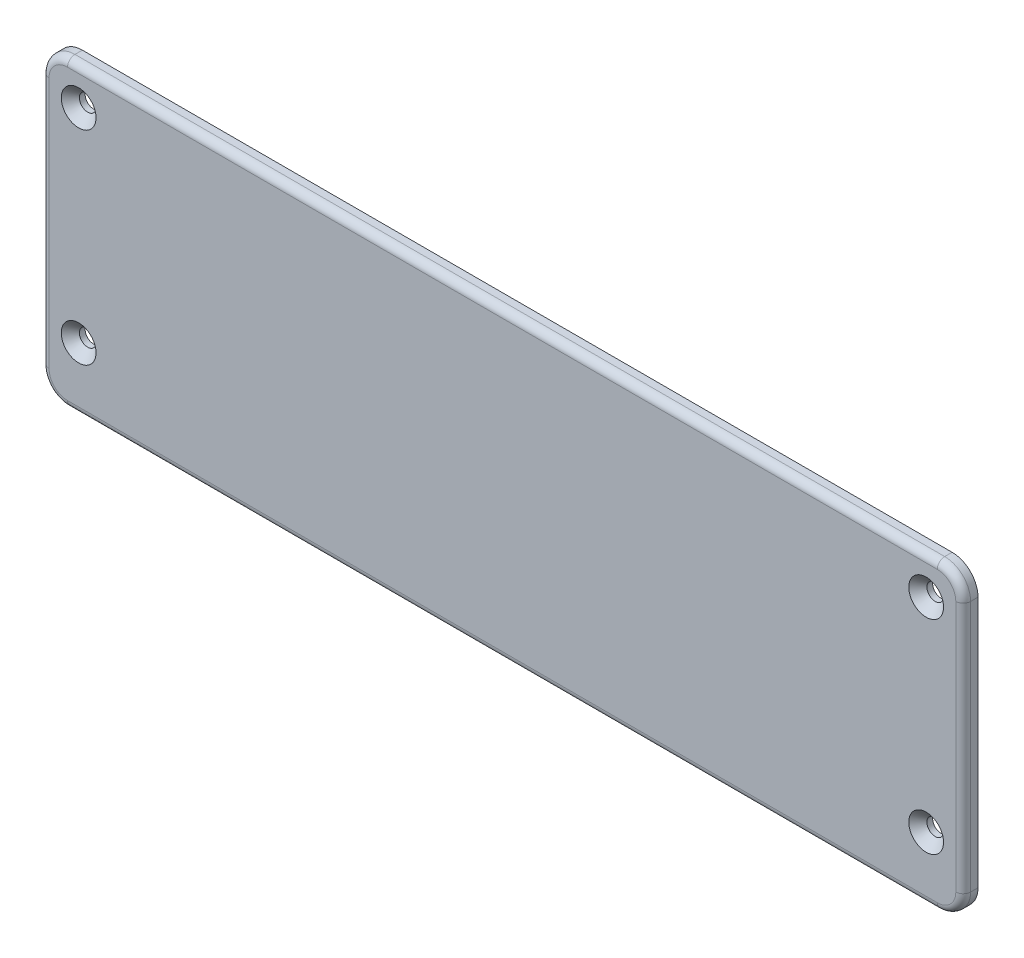
ISO-10303-21;
HEADER;
FILE_DESCRIPTION(('STEP AP214'),'2;1');
FILE_NAME('part.step','',(''),(''),'','','');
FILE_SCHEMA(('AUTOMOTIVE_DESIGN { 1 0 10303 214 1 1 1 1 }'));
ENDSEC;
DATA;
#1=APPLICATION_CONTEXT('core data for automotive mechanical design processes');
#2=APPLICATION_PROTOCOL_DEFINITION('international standard','automotive_design',2000,#1);
#3=PRODUCT_CONTEXT('',#1,'mechanical');
#4=PRODUCT('Part','Part','',(#3));
#5=PRODUCT_RELATED_PRODUCT_CATEGORY('part','',(#4));
#6=PRODUCT_DEFINITION_FORMATION('','',#4);
#7=PRODUCT_DEFINITION_CONTEXT('part definition',#1,'design');
#8=PRODUCT_DEFINITION('design','',#6,#7);
#9=PRODUCT_DEFINITION_SHAPE('','',#8);
#10=(LENGTH_UNIT() NAMED_UNIT(*) SI_UNIT(.MILLI.,.METRE.));
#11=(NAMED_UNIT(*) PLANE_ANGLE_UNIT() SI_UNIT($,.RADIAN.));
#12=(NAMED_UNIT(*) SI_UNIT($,.STERADIAN.) SOLID_ANGLE_UNIT());
#13=UNCERTAINTY_MEASURE_WITH_UNIT(LENGTH_MEASURE(1.E-05),#10,'distance_accuracy_value','');
#14=(GEOMETRIC_REPRESENTATION_CONTEXT(3) GLOBAL_UNCERTAINTY_ASSIGNED_CONTEXT((#13)) GLOBAL_UNIT_ASSIGNED_CONTEXT((#10,
#11,#12)) REPRESENTATION_CONTEXT('',''));
#15=CARTESIAN_POINT('',(0.,0.,0.));
#16=DIRECTION('',(0.,0.,1.));
#17=DIRECTION('',(1.,0.,0.));
#18=AXIS2_PLACEMENT_3D('',#15,#16,#17);
#19=CARTESIAN_POINT('',(-124.5,41.,4.));
#20=DIRECTION('',(0.,-1.,0.));
#21=DIRECTION('',(0.,0.,-1.));
#22=AXIS2_PLACEMENT_3D('',#19,#20,#21);
#23=PLANE('',#22);
#24=DIRECTION('',(0.,0.,-1.));
#25=VECTOR('',#24,1.);
#26=CARTESIAN_POINT('',(-117.5,41.,4.));
#27=LINE('',#26,#25);
#28=CARTESIAN_POINT('',(-117.5,41.,0.));
#29=VERTEX_POINT('',#28);
#30=CARTESIAN_POINT('',(-117.5,41.,2.));
#31=VERTEX_POINT('',#30);
#32=EDGE_CURVE('E143',#29,#31,#27,.F.);
#33=ORIENTED_EDGE('',*,*,#32,.T.);
#34=DIRECTION('',(-1.,0.,0.));
#35=VECTOR('',#34,1.);
#36=CARTESIAN_POINT('',(-124.5,41.,2.));
#37=LINE('',#36,#35);
#38=CARTESIAN_POINT('',(117.5,41.,2.));
#39=VERTEX_POINT('',#38);
#40=EDGE_CURVE('E139',#31,#39,#37,.F.);
#41=ORIENTED_EDGE('',*,*,#40,.T.);
#42=DIRECTION('',(0.,0.,-1.));
#43=VECTOR('',#42,1.);
#44=CARTESIAN_POINT('',(117.5,41.,4.));
#45=LINE('',#44,#43);
#46=CARTESIAN_POINT('',(117.5,41.,0.));
#47=VERTEX_POINT('',#46);
#48=EDGE_CURVE('E132',#39,#47,#45,.T.);
#49=ORIENTED_EDGE('',*,*,#48,.T.);
#50=DIRECTION('',(-1.,0.,0.));
#51=VECTOR('',#50,1.);
#52=CARTESIAN_POINT('',(-124.5,41.,0.));
#53=LINE('',#52,#51);
#54=EDGE_CURVE('E136',#47,#29,#53,.T.);
#55=ORIENTED_EDGE('',*,*,#54,.T.);
#56=EDGE_LOOP('',(#33,#41,#49,#55));
#57=FACE_BOUND('',#56,.T.);
#58=ADVANCED_FACE('F41',(#57),#23,.F.);
#59=CARTESIAN_POINT('',(-124.5,41.,4.));
#60=DIRECTION('',(1.,0.,0.));
#61=DIRECTION('',(0.,0.,-1.));
#62=AXIS2_PLACEMENT_3D('',#59,#60,#61);
#63=PLANE('',#62);
#64=DIRECTION('',(0.,0.,-1.));
#65=VECTOR('',#64,1.);
#66=CARTESIAN_POINT('',(-124.5,-34.,4.));
#67=LINE('',#66,#65);
#68=CARTESIAN_POINT('',(-124.5,-34.,0.));
#69=VERTEX_POINT('',#68);
#70=CARTESIAN_POINT('',(-124.5,-34.,2.));
#71=VERTEX_POINT('',#70);
#72=EDGE_CURVE('E186',#69,#71,#67,.F.);
#73=ORIENTED_EDGE('',*,*,#72,.T.);
#74=DIRECTION('',(0.,-1.,0.));
#75=VECTOR('',#74,1.);
#76=CARTESIAN_POINT('',(-124.5,41.,2.));
#77=LINE('',#76,#75);
#78=CARTESIAN_POINT('',(-124.5,34.,2.));
#79=VERTEX_POINT('',#78);
#80=EDGE_CURVE('E209',#71,#79,#77,.F.);
#81=ORIENTED_EDGE('',*,*,#80,.T.);
#82=DIRECTION('',(0.,0.,-1.));
#83=VECTOR('',#82,1.);
#84=CARTESIAN_POINT('',(-124.5,34.,4.));
#85=LINE('',#84,#83);
#86=CARTESIAN_POINT('',(-124.5,34.,0.));
#87=VERTEX_POINT('',#86);
#88=EDGE_CURVE('E184',#79,#87,#85,.T.);
#89=ORIENTED_EDGE('',*,*,#88,.T.);
#90=DIRECTION('',(0.,-1.,0.));
#91=VECTOR('',#90,1.);
#92=CARTESIAN_POINT('',(-124.5,41.,0.));
#93=LINE('',#92,#91);
#94=EDGE_CURVE('E158',#87,#69,#93,.T.);
#95=ORIENTED_EDGE('',*,*,#94,.T.);
#96=EDGE_LOOP('',(#73,#81,#89,#95));
#97=FACE_BOUND('',#96,.T.);
#98=ADVANCED_FACE('F303',(#97),#63,.F.);
#99=CARTESIAN_POINT('',(-124.5,-41.,4.));
#100=DIRECTION('',(0.,1.,0.));
#101=DIRECTION('',(0.,0.,1.));
#102=AXIS2_PLACEMENT_3D('',#99,#100,#101);
#103=PLANE('',#102);
#104=DIRECTION('',(0.,0.,-1.));
#105=VECTOR('',#104,1.);
#106=CARTESIAN_POINT('',(117.5,-41.,4.));
#107=LINE('',#106,#105);
#108=CARTESIAN_POINT('',(117.5,-41.,0.));
#109=VERTEX_POINT('',#108);
#110=CARTESIAN_POINT('',(117.5,-41.,2.));
#111=VERTEX_POINT('',#110);
#112=EDGE_CURVE('E182',#109,#111,#107,.F.);
#113=ORIENTED_EDGE('',*,*,#112,.T.);
#114=DIRECTION('',(1.,0.,0.));
#115=VECTOR('',#114,1.);
#116=CARTESIAN_POINT('',(-124.5,-41.,2.));
#117=LINE('',#116,#115);
#118=CARTESIAN_POINT('',(-117.5,-41.,2.));
#119=VERTEX_POINT('',#118);
#120=EDGE_CURVE('E11',#111,#119,#117,.F.);
#121=ORIENTED_EDGE('',*,*,#120,.T.);
#122=DIRECTION('',(0.,0.,-1.));
#123=VECTOR('',#122,1.);
#124=CARTESIAN_POINT('',(-117.5,-41.,4.));
#125=LINE('',#124,#123);
#126=CARTESIAN_POINT('',(-117.5,-41.,0.));
#127=VERTEX_POINT('',#126);
#128=EDGE_CURVE('E180',#119,#127,#125,.T.);
#129=ORIENTED_EDGE('',*,*,#128,.T.);
#130=DIRECTION('',(1.,0.,0.));
#131=VECTOR('',#130,1.);
#132=CARTESIAN_POINT('',(-124.5,-41.,0.));
#133=LINE('',#132,#131);
#134=EDGE_CURVE('E162',#127,#109,#133,.T.);
#135=ORIENTED_EDGE('',*,*,#134,.T.);
#136=EDGE_LOOP('',(#113,#121,#129,#135));
#137=FACE_BOUND('',#136,.T.);
#138=ADVANCED_FACE('F298',(#137),#103,.F.);
#139=CARTESIAN_POINT('',(124.5,41.,4.));
#140=DIRECTION('',(-1.,0.,0.));
#141=DIRECTION('',(0.,0.,1.));
#142=AXIS2_PLACEMENT_3D('',#139,#140,#141);
#143=PLANE('',#142);
#144=DIRECTION('',(0.,0.,-1.));
#145=VECTOR('',#144,1.);
#146=CARTESIAN_POINT('',(124.5,34.,4.));
#147=LINE('',#146,#145);
#148=CARTESIAN_POINT('',(124.5,34.,0.));
#149=VERTEX_POINT('',#148);
#150=CARTESIAN_POINT('',(124.5,34.,2.));
#151=VERTEX_POINT('',#150);
#152=EDGE_CURVE('E148',#149,#151,#147,.F.);
#153=ORIENTED_EDGE('',*,*,#152,.T.);
#154=DIRECTION('',(0.,1.,0.));
#155=VECTOR('',#154,1.);
#156=CARTESIAN_POINT('',(124.5,41.,2.));
#157=LINE('',#156,#155);
#158=CARTESIAN_POINT('',(124.5,-34.,2.));
#159=VERTEX_POINT('',#158);
#160=EDGE_CURVE('E65',#151,#159,#157,.F.);
#161=ORIENTED_EDGE('',*,*,#160,.T.);
#162=DIRECTION('',(0.,0.,-1.));
#163=VECTOR('',#162,1.);
#164=CARTESIAN_POINT('',(124.5,-34.,4.));
#165=LINE('',#164,#163);
#166=CARTESIAN_POINT('',(124.5,-34.,0.));
#167=VERTEX_POINT('',#166);
#168=EDGE_CURVE('E152',#159,#167,#165,.T.);
#169=ORIENTED_EDGE('',*,*,#168,.T.);
#170=DIRECTION('',(0.,1.,0.));
#171=VECTOR('',#170,1.);
#172=CARTESIAN_POINT('',(124.5,41.,0.));
#173=LINE('',#172,#171);
#174=EDGE_CURVE('E171',#167,#149,#173,.T.);
#175=ORIENTED_EDGE('',*,*,#174,.T.);
#176=EDGE_LOOP('',(#153,#161,#169,#175));
#177=FACE_BOUND('',#176,.T.);
#178=ADVANCED_FACE('F288',(#177),#143,.F.);
#179=CARTESIAN_POINT('',(0.,0.,4.));
#180=DIRECTION('',(0.,0.,-1.));
#181=DIRECTION('',(-1.,0.,0.));
#182=AXIS2_PLACEMENT_3D('',#179,#180,#181);
#183=PLANE('',#182);
#184=DIRECTION('',(0.,-1.,0.));
#185=VECTOR('',#184,1.);
#186=CARTESIAN_POINT('',(-122.5,0.,4.));
#187=LINE('',#186,#185);
#188=CARTESIAN_POINT('',(-122.5,34.,4.));
#189=VERTEX_POINT('',#188);
#190=CARTESIAN_POINT('',(-122.5,-34.,4.));
#191=VERTEX_POINT('',#190);
#192=EDGE_CURVE('E201',#189,#191,#187,.T.);
#193=ORIENTED_EDGE('',*,*,#192,.T.);
#194=CARTESIAN_POINT('',(-117.5,-34.,4.));
#195=DIRECTION('',(0.,0.,-1.));
#196=DIRECTION('',(-1.,0.,0.));
#197=AXIS2_PLACEMENT_3D('',#194,#195,#196);
#198=CIRCLE('',#197,5.);
#199=CARTESIAN_POINT('',(-117.5,-39.,4.));
#200=VERTEX_POINT('',#199);
#201=EDGE_CURVE('E203',#191,#200,#198,.F.);
#202=ORIENTED_EDGE('',*,*,#201,.T.);
#203=DIRECTION('',(1.,0.,0.));
#204=VECTOR('',#203,1.);
#205=CARTESIAN_POINT('',(0.,-39.,4.));
#206=LINE('',#205,#204);
#207=CARTESIAN_POINT('',(117.5,-39.,4.));
#208=VERTEX_POINT('',#207);
#209=EDGE_CURVE('E189',#200,#208,#206,.T.);
#210=ORIENTED_EDGE('',*,*,#209,.T.);
#211=CARTESIAN_POINT('',(117.5,-34.,4.));
#212=DIRECTION('',(0.,0.,-1.));
#213=DIRECTION('',(-1.,0.,0.));
#214=AXIS2_PLACEMENT_3D('',#211,#212,#213);
#215=CIRCLE('',#214,5.);
#216=CARTESIAN_POINT('',(122.5,-34.,4.));
#217=VERTEX_POINT('',#216);
#218=EDGE_CURVE('E191',#208,#217,#215,.F.);
#219=ORIENTED_EDGE('',*,*,#218,.T.);
#220=DIRECTION('',(0.,1.,0.));
#221=VECTOR('',#220,1.);
#222=CARTESIAN_POINT('',(122.5,0.,4.));
#223=LINE('',#222,#221);
#224=CARTESIAN_POINT('',(122.5,34.,4.));
#225=VERTEX_POINT('',#224);
#226=EDGE_CURVE('E193',#217,#225,#223,.T.);
#227=ORIENTED_EDGE('',*,*,#226,.T.);
#228=CARTESIAN_POINT('',(117.5,34.,4.));
#229=DIRECTION('',(0.,0.,-1.));
#230=DIRECTION('',(-1.,0.,0.));
#231=AXIS2_PLACEMENT_3D('',#228,#229,#230);
#232=CIRCLE('',#231,5.);
#233=CARTESIAN_POINT('',(117.5,39.,4.));
#234=VERTEX_POINT('',#233);
#235=EDGE_CURVE('E195',#225,#234,#232,.F.);
#236=ORIENTED_EDGE('',*,*,#235,.T.);
#237=DIRECTION('',(-1.,0.,0.));
#238=VECTOR('',#237,1.);
#239=CARTESIAN_POINT('',(0.,39.,4.));
#240=LINE('',#239,#238);
#241=CARTESIAN_POINT('',(-117.5,39.,4.));
#242=VERTEX_POINT('',#241);
#243=EDGE_CURVE('E197',#234,#242,#240,.T.);
#244=ORIENTED_EDGE('',*,*,#243,.T.);
#245=CARTESIAN_POINT('',(-117.5,34.,4.));
#246=DIRECTION('',(0.,0.,-1.));
#247=DIRECTION('',(-1.,0.,0.));
#248=AXIS2_PLACEMENT_3D('',#245,#246,#247);
#249=CIRCLE('',#248,5.);
#250=EDGE_CURVE('E199',#242,#189,#249,.F.);
#251=ORIENTED_EDGE('',*,*,#250,.T.);
#252=EDGE_LOOP('',(#193,#202,#210,#219,#227,#236,#244,#251));
#253=FACE_BOUND('',#252,.T.);
#254=CARTESIAN_POINT('',(114.5,-24.,4.));
#255=DIRECTION('',(0.,0.,1.));
#256=DIRECTION('',(1.,0.,0.));
#257=AXIS2_PLACEMENT_3D('',#254,#255,#256);
#258=CIRCLE('',#257,4.7);
#259=CARTESIAN_POINT('',(119.2,-24.,4.));
#260=VERTEX_POINT('',#259);
#261=EDGE_CURVE('E239',#260,#260,#258,.T.);
#262=ORIENTED_EDGE('',*,*,#261,.F.);
#263=EDGE_LOOP('',(#262));
#264=FACE_BOUND('',#263,.T.);
#265=CARTESIAN_POINT('',(114.5,31.,4.));
#266=DIRECTION('',(0.,0.,1.));
#267=DIRECTION('',(1.,0.,0.));
#268=AXIS2_PLACEMENT_3D('',#265,#266,#267);
#269=CIRCLE('',#268,4.7);
#270=CARTESIAN_POINT('',(119.2,31.,4.));
#271=VERTEX_POINT('',#270);
#272=EDGE_CURVE('E254',#271,#271,#269,.T.);
#273=ORIENTED_EDGE('',*,*,#272,.F.);
#274=EDGE_LOOP('',(#273));
#275=FACE_BOUND('',#274,.T.);
#276=CARTESIAN_POINT('',(-114.5,31.,4.));
#277=DIRECTION('',(0.,0.,1.));
#278=DIRECTION('',(1.,0.,0.));
#279=AXIS2_PLACEMENT_3D('',#276,#277,#278);
#280=CIRCLE('',#279,4.7);
#281=CARTESIAN_POINT('',(-109.8,31.,4.));
#282=VERTEX_POINT('',#281);
#283=EDGE_CURVE('E263',#282,#282,#280,.T.);
#284=ORIENTED_EDGE('',*,*,#283,.F.);
#285=EDGE_LOOP('',(#284));
#286=FACE_BOUND('',#285,.T.);
#287=CARTESIAN_POINT('',(-114.5,-24.,4.));
#288=DIRECTION('',(0.,0.,1.));
#289=DIRECTION('',(1.,0.,0.));
#290=AXIS2_PLACEMENT_3D('',#287,#288,#289);
#291=CIRCLE('',#290,4.7);
#292=CARTESIAN_POINT('',(-109.8,-24.,4.));
#293=VERTEX_POINT('',#292);
#294=EDGE_CURVE('E272',#293,#293,#291,.T.);
#295=ORIENTED_EDGE('',*,*,#294,.F.);
#296=EDGE_LOOP('',(#295));
#297=FACE_BOUND('',#296,.T.);
#298=ADVANCED_FACE('F286',(#253,#264,#275,#286,#297),#183,.F.);
#299=CARTESIAN_POINT('',(0.,0.,0.));
#300=DIRECTION('',(0.,0.,-1.));
#301=DIRECTION('',(-1.,0.,0.));
#302=AXIS2_PLACEMENT_3D('',#299,#300,#301);
#303=PLANE('',#302);
#304=CARTESIAN_POINT('',(114.5,-24.,0.));
#305=DIRECTION('',(0.,0.,1.));
#306=DIRECTION('',(1.,0.,0.));
#307=AXIS2_PLACEMENT_3D('',#304,#305,#306);
#308=CIRCLE('',#307,2.25);
#309=CARTESIAN_POINT('',(116.75,-24.,0.));
#310=VERTEX_POINT('',#309);
#311=EDGE_CURVE('E249',#310,#310,#308,.T.);
#312=ORIENTED_EDGE('',*,*,#311,.T.);
#313=EDGE_LOOP('',(#312));
#314=FACE_BOUND('',#313,.T.);
#315=CARTESIAN_POINT('',(114.5,31.,0.));
#316=DIRECTION('',(0.,0.,1.));
#317=DIRECTION('',(1.,0.,0.));
#318=AXIS2_PLACEMENT_3D('',#315,#316,#317);
#319=CIRCLE('',#318,2.25);
#320=CARTESIAN_POINT('',(116.75,31.,0.));
#321=VERTEX_POINT('',#320);
#322=EDGE_CURVE('E260',#321,#321,#319,.T.);
#323=ORIENTED_EDGE('',*,*,#322,.T.);
#324=EDGE_LOOP('',(#323));
#325=FACE_BOUND('',#324,.T.);
#326=CARTESIAN_POINT('',(-114.5,31.,0.));
#327=DIRECTION('',(0.,0.,1.));
#328=DIRECTION('',(1.,0.,0.));
#329=AXIS2_PLACEMENT_3D('',#326,#327,#328);
#330=CIRCLE('',#329,2.25);
#331=CARTESIAN_POINT('',(-112.25,31.,0.));
#332=VERTEX_POINT('',#331);
#333=EDGE_CURVE('E269',#332,#332,#330,.T.);
#334=ORIENTED_EDGE('',*,*,#333,.T.);
#335=EDGE_LOOP('',(#334));
#336=FACE_BOUND('',#335,.T.);
#337=CARTESIAN_POINT('',(-114.5,-24.,0.));
#338=DIRECTION('',(0.,0.,1.));
#339=DIRECTION('',(1.,0.,0.));
#340=AXIS2_PLACEMENT_3D('',#337,#338,#339);
#341=CIRCLE('',#340,2.25);
#342=CARTESIAN_POINT('',(-112.25,-24.,0.));
#343=VERTEX_POINT('',#342);
#344=EDGE_CURVE('E159',#343,#343,#341,.T.);
#345=ORIENTED_EDGE('',*,*,#344,.T.);
#346=EDGE_LOOP('',(#345));
#347=FACE_BOUND('',#346,.T.);
#348=ORIENTED_EDGE('',*,*,#54,.F.);
#349=CARTESIAN_POINT('',(117.5,34.,0.));
#350=DIRECTION('',(0.,0.,-1.));
#351=DIRECTION('',(-1.,0.,0.));
#352=AXIS2_PLACEMENT_3D('',#349,#350,#351);
#353=CIRCLE('',#352,7.);
#354=EDGE_CURVE('E146',#47,#149,#353,.T.);
#355=ORIENTED_EDGE('',*,*,#354,.T.);
#356=ORIENTED_EDGE('',*,*,#174,.F.);
#357=CARTESIAN_POINT('',(117.5,-34.,0.));
#358=DIRECTION('',(0.,0.,-1.));
#359=DIRECTION('',(-1.,0.,0.));
#360=AXIS2_PLACEMENT_3D('',#357,#358,#359);
#361=CIRCLE('',#360,7.);
#362=EDGE_CURVE('E153',#167,#109,#361,.T.);
#363=ORIENTED_EDGE('',*,*,#362,.T.);
#364=ORIENTED_EDGE('',*,*,#134,.F.);
#365=CARTESIAN_POINT('',(-117.5,-34.,0.));
#366=DIRECTION('',(0.,0.,-1.));
#367=DIRECTION('',(-1.,0.,0.));
#368=AXIS2_PLACEMENT_3D('',#365,#366,#367);
#369=CIRCLE('',#368,7.);
#370=EDGE_CURVE('E175',#127,#69,#369,.T.);
#371=ORIENTED_EDGE('',*,*,#370,.T.);
#372=ORIENTED_EDGE('',*,*,#94,.F.);
#373=CARTESIAN_POINT('',(-117.5,34.,0.));
#374=DIRECTION('',(0.,0.,-1.));
#375=DIRECTION('',(-1.,0.,0.));
#376=AXIS2_PLACEMENT_3D('',#373,#374,#375);
#377=CIRCLE('',#376,7.);
#378=EDGE_CURVE('E142',#87,#29,#377,.T.);
#379=ORIENTED_EDGE('',*,*,#378,.T.);
#380=EDGE_LOOP('',(#348,#355,#356,#363,#364,#371,#372,#379));
#381=FACE_BOUND('',#380,.T.);
#382=ADVANCED_FACE('F155',(#314,#325,#336,#347,#381),#303,.T.);
#383=CARTESIAN_POINT('',(-114.5,-24.,4.));
#384=DIRECTION('',(0.,0.,1.));
#385=DIRECTION('',(1.,0.,0.));
#386=AXIS2_PLACEMENT_3D('',#383,#384,#385);
#387=CYLINDRICAL_SURFACE('',#386,2.25);
#388=ORIENTED_EDGE('',*,*,#344,.F.);
#389=EDGE_LOOP('',(#388));
#390=FACE_BOUND('',#389,.T.);
#391=CARTESIAN_POINT('',(-114.5,-24.,1.54999999999999));
#392=DIRECTION('',(0.,0.,1.));
#393=DIRECTION('',(1.,0.,0.));
#394=AXIS2_PLACEMENT_3D('',#391,#392,#393);
#395=CIRCLE('',#394,2.24999999999999);
#396=CARTESIAN_POINT('',(-112.25,-24.,1.54999999999999));
#397=VERTEX_POINT('',#396);
#398=EDGE_CURVE('E165',#397,#397,#395,.T.);
#399=ORIENTED_EDGE('',*,*,#398,.T.);
#400=EDGE_LOOP('',(#399));
#401=FACE_BOUND('',#400,.T.);
#402=ADVANCED_FACE('F277',(#390,#401),#387,.F.);
#403=CARTESIAN_POINT('',(-114.5,-24.,4.));
#404=DIRECTION('',(0.,0.,1.));
#405=DIRECTION('',(1.,0.,0.));
#406=AXIS2_PLACEMENT_3D('',#403,#404,#405);
#407=CONICAL_SURFACE('',#406,4.7,0.785398163397448);
#408=ORIENTED_EDGE('',*,*,#398,.F.);
#409=EDGE_LOOP('',(#408));
#410=FACE_BOUND('',#409,.T.);
#411=ORIENTED_EDGE('',*,*,#294,.T.);
#412=EDGE_LOOP('',(#411));
#413=FACE_BOUND('',#412,.T.);
#414=ADVANCED_FACE('F279',(#410,#413),#407,.F.);
#415=CARTESIAN_POINT('',(-114.5,31.,4.));
#416=DIRECTION('',(0.,0.,1.));
#417=DIRECTION('',(1.,0.,0.));
#418=AXIS2_PLACEMENT_3D('',#415,#416,#417);
#419=CYLINDRICAL_SURFACE('',#418,2.25);
#420=ORIENTED_EDGE('',*,*,#333,.F.);
#421=EDGE_LOOP('',(#420));
#422=FACE_BOUND('',#421,.T.);
#423=CARTESIAN_POINT('',(-114.5,31.,1.54999999999999));
#424=DIRECTION('',(0.,0.,1.));
#425=DIRECTION('',(1.,0.,0.));
#426=AXIS2_PLACEMENT_3D('',#423,#424,#425);
#427=CIRCLE('',#426,2.24999999999999);
#428=CARTESIAN_POINT('',(-112.25,31.,1.54999999999999));
#429=VERTEX_POINT('',#428);
#430=EDGE_CURVE('E266',#429,#429,#427,.T.);
#431=ORIENTED_EDGE('',*,*,#430,.T.);
#432=EDGE_LOOP('',(#431));
#433=FACE_BOUND('',#432,.T.);
#434=ADVANCED_FACE('F282',(#422,#433),#419,.F.);
#435=CARTESIAN_POINT('',(-114.5,31.,4.));
#436=DIRECTION('',(0.,0.,1.));
#437=DIRECTION('',(1.,0.,0.));
#438=AXIS2_PLACEMENT_3D('',#435,#436,#437);
#439=CONICAL_SURFACE('',#438,4.7,0.785398163397448);
#440=ORIENTED_EDGE('',*,*,#430,.F.);
#441=EDGE_LOOP('',(#440));
#442=FACE_BOUND('',#441,.T.);
#443=ORIENTED_EDGE('',*,*,#283,.T.);
#444=EDGE_LOOP('',(#443));
#445=FACE_BOUND('',#444,.T.);
#446=ADVANCED_FACE('F423',(#442,#445),#439,.F.);
#447=CARTESIAN_POINT('',(114.5,31.,4.));
#448=DIRECTION('',(0.,0.,1.));
#449=DIRECTION('',(1.,0.,0.));
#450=AXIS2_PLACEMENT_3D('',#447,#448,#449);
#451=CYLINDRICAL_SURFACE('',#450,2.25);
#452=ORIENTED_EDGE('',*,*,#322,.F.);
#453=EDGE_LOOP('',(#452));
#454=FACE_BOUND('',#453,.T.);
#455=CARTESIAN_POINT('',(114.5,31.,1.54999999999999));
#456=DIRECTION('',(0.,0.,1.));
#457=DIRECTION('',(1.,0.,0.));
#458=AXIS2_PLACEMENT_3D('',#455,#456,#457);
#459=CIRCLE('',#458,2.24999999999999);
#460=CARTESIAN_POINT('',(116.75,31.,1.54999999999999));
#461=VERTEX_POINT('',#460);
#462=EDGE_CURVE('E257',#461,#461,#459,.T.);
#463=ORIENTED_EDGE('',*,*,#462,.T.);
#464=EDGE_LOOP('',(#463));
#465=FACE_BOUND('',#464,.T.);
#466=ADVANCED_FACE('F433',(#454,#465),#451,.F.);
#467=CARTESIAN_POINT('',(114.5,31.,4.));
#468=DIRECTION('',(0.,0.,1.));
#469=DIRECTION('',(1.,0.,0.));
#470=AXIS2_PLACEMENT_3D('',#467,#468,#469);
#471=CONICAL_SURFACE('',#470,4.7,0.785398163397448);
#472=ORIENTED_EDGE('',*,*,#462,.F.);
#473=EDGE_LOOP('',(#472));
#474=FACE_BOUND('',#473,.T.);
#475=ORIENTED_EDGE('',*,*,#272,.T.);
#476=EDGE_LOOP('',(#475));
#477=FACE_BOUND('',#476,.T.);
#478=ADVANCED_FACE('F443',(#474,#477),#471,.F.);
#479=CARTESIAN_POINT('',(114.5,-24.,4.));
#480=DIRECTION('',(0.,0.,1.));
#481=DIRECTION('',(1.,0.,0.));
#482=AXIS2_PLACEMENT_3D('',#479,#480,#481);
#483=CYLINDRICAL_SURFACE('',#482,2.25);
#484=ORIENTED_EDGE('',*,*,#311,.F.);
#485=EDGE_LOOP('',(#484));
#486=FACE_BOUND('',#485,.T.);
#487=CARTESIAN_POINT('',(114.5,-24.,1.54999999999999));
#488=DIRECTION('',(0.,0.,1.));
#489=DIRECTION('',(1.,0.,0.));
#490=AXIS2_PLACEMENT_3D('',#487,#488,#489);
#491=CIRCLE('',#490,2.24999999999999);
#492=CARTESIAN_POINT('',(116.75,-24.,1.54999999999999));
#493=VERTEX_POINT('',#492);
#494=EDGE_CURVE('E244',#493,#493,#491,.T.);
#495=ORIENTED_EDGE('',*,*,#494,.T.);
#496=EDGE_LOOP('',(#495));
#497=FACE_BOUND('',#496,.T.);
#498=ADVANCED_FACE('F453',(#486,#497),#483,.F.);
#499=CARTESIAN_POINT('',(114.5,-24.,4.));
#500=DIRECTION('',(0.,0.,1.));
#501=DIRECTION('',(1.,0.,0.));
#502=AXIS2_PLACEMENT_3D('',#499,#500,#501);
#503=CONICAL_SURFACE('',#502,4.7,0.785398163397448);
#504=ORIENTED_EDGE('',*,*,#494,.F.);
#505=EDGE_LOOP('',(#504));
#506=FACE_BOUND('',#505,.T.);
#507=ORIENTED_EDGE('',*,*,#261,.T.);
#508=EDGE_LOOP('',(#507));
#509=FACE_BOUND('',#508,.T.);
#510=ADVANCED_FACE('F314',(#506,#509),#503,.F.);
#511=CARTESIAN_POINT('',(117.5,34.,4.));
#512=DIRECTION('',(0.,0.,-1.));
#513=DIRECTION('',(-1.,0.,0.));
#514=AXIS2_PLACEMENT_3D('',#511,#512,#513);
#515=CYLINDRICAL_SURFACE('',#514,7.);
#516=ORIENTED_EDGE('',*,*,#48,.F.);
#517=CARTESIAN_POINT('',(117.5,34.,2.));
#518=DIRECTION('',(0.,0.,-1.));
#519=DIRECTION('',(-1.,0.,0.));
#520=AXIS2_PLACEMENT_3D('',#517,#518,#519);
#521=CIRCLE('',#520,7.);
#522=EDGE_CURVE('E214',#39,#151,#521,.T.);
#523=ORIENTED_EDGE('',*,*,#522,.T.);
#524=ORIENTED_EDGE('',*,*,#152,.F.);
#525=ORIENTED_EDGE('',*,*,#354,.F.);
#526=EDGE_LOOP('',(#516,#523,#524,#525));
#527=FACE_BOUND('',#526,.T.);
#528=ADVANCED_FACE('F147',(#527),#515,.T.);
#529=CARTESIAN_POINT('',(117.5,-34.,4.));
#530=DIRECTION('',(0.,0.,-1.));
#531=DIRECTION('',(-1.,0.,0.));
#532=AXIS2_PLACEMENT_3D('',#529,#530,#531);
#533=CYLINDRICAL_SURFACE('',#532,7.);
#534=ORIENTED_EDGE('',*,*,#168,.F.);
#535=CARTESIAN_POINT('',(117.5,-34.,2.));
#536=DIRECTION('',(0.,0.,-1.));
#537=DIRECTION('',(-1.,0.,0.));
#538=AXIS2_PLACEMENT_3D('',#535,#536,#537);
#539=CIRCLE('',#538,7.);
#540=EDGE_CURVE('E50',#159,#111,#539,.T.);
#541=ORIENTED_EDGE('',*,*,#540,.T.);
#542=ORIENTED_EDGE('',*,*,#112,.F.);
#543=ORIENTED_EDGE('',*,*,#362,.F.);
#544=EDGE_LOOP('',(#534,#541,#542,#543));
#545=FACE_BOUND('',#544,.T.);
#546=ADVANCED_FACE('F313',(#545),#533,.T.);
#547=CARTESIAN_POINT('',(-117.5,-34.,4.));
#548=DIRECTION('',(0.,0.,-1.));
#549=DIRECTION('',(-1.,0.,0.));
#550=AXIS2_PLACEMENT_3D('',#547,#548,#549);
#551=CYLINDRICAL_SURFACE('',#550,7.);
#552=ORIENTED_EDGE('',*,*,#128,.F.);
#553=CARTESIAN_POINT('',(-117.5,-34.,2.));
#554=DIRECTION('',(0.,0.,-1.));
#555=DIRECTION('',(-1.,0.,0.));
#556=AXIS2_PLACEMENT_3D('',#553,#554,#555);
#557=CIRCLE('',#556,7.);
#558=EDGE_CURVE('E206',#119,#71,#557,.T.);
#559=ORIENTED_EDGE('',*,*,#558,.T.);
#560=ORIENTED_EDGE('',*,*,#72,.F.);
#561=ORIENTED_EDGE('',*,*,#370,.F.);
#562=EDGE_LOOP('',(#552,#559,#560,#561));
#563=FACE_BOUND('',#562,.T.);
#564=ADVANCED_FACE('F317',(#563),#551,.T.);
#565=CARTESIAN_POINT('',(-117.5,34.,4.));
#566=DIRECTION('',(0.,0.,-1.));
#567=DIRECTION('',(-1.,0.,0.));
#568=AXIS2_PLACEMENT_3D('',#565,#566,#567);
#569=CYLINDRICAL_SURFACE('',#568,7.);
#570=ORIENTED_EDGE('',*,*,#88,.F.);
#571=CARTESIAN_POINT('',(-117.5,34.,2.));
#572=DIRECTION('',(0.,0.,-1.));
#573=DIRECTION('',(-1.,0.,0.));
#574=AXIS2_PLACEMENT_3D('',#571,#572,#573);
#575=CIRCLE('',#574,7.);
#576=EDGE_CURVE('E211',#79,#31,#575,.T.);
#577=ORIENTED_EDGE('',*,*,#576,.T.);
#578=ORIENTED_EDGE('',*,*,#32,.F.);
#579=ORIENTED_EDGE('',*,*,#378,.F.);
#580=EDGE_LOOP('',(#570,#577,#578,#579));
#581=FACE_BOUND('',#580,.T.);
#582=ADVANCED_FACE('F320',(#581),#569,.T.);
#583=CARTESIAN_POINT('',(117.5,34.,2.));
#584=DIRECTION('',(0.,0.,-1.));
#585=DIRECTION('',(-1.,0.,0.));
#586=AXIS2_PLACEMENT_3D('',#583,#584,#585);
#587=TOROIDAL_SURFACE('',#586,5.,2.);
#588=CARTESIAN_POINT('',(122.5,34.,2.));
#589=DIRECTION('',(0.,-1.,0.));
#590=DIRECTION('',(0.,0.,-1.));
#591=AXIS2_PLACEMENT_3D('',#588,#589,#590);
#592=CIRCLE('',#591,2.);
#593=EDGE_CURVE('E233',#151,#225,#592,.T.);
#594=ORIENTED_EDGE('',*,*,#593,.F.);
#595=ORIENTED_EDGE('',*,*,#522,.F.);
#596=CARTESIAN_POINT('',(117.5,39.,2.));
#597=DIRECTION('',(-1.,0.,0.));
#598=DIRECTION('',(0.,0.,1.));
#599=AXIS2_PLACEMENT_3D('',#596,#597,#598);
#600=CIRCLE('',#599,2.);
#601=EDGE_CURVE('E45',#234,#39,#600,.T.);
#602=ORIENTED_EDGE('',*,*,#601,.F.);
#603=ORIENTED_EDGE('',*,*,#235,.F.);
#604=EDGE_LOOP('',(#594,#595,#602,#603));
#605=FACE_BOUND('',#604,.T.);
#606=ADVANCED_FACE('F43',(#605),#587,.T.);
#607=CARTESIAN_POINT('',(0.,39.,2.));
#608=DIRECTION('',(-1.,0.,0.));
#609=DIRECTION('',(0.,0.,1.));
#610=AXIS2_PLACEMENT_3D('',#607,#608,#609);
#611=CYLINDRICAL_SURFACE('',#610,2.);
#612=ORIENTED_EDGE('',*,*,#601,.T.);
#613=ORIENTED_EDGE('',*,*,#40,.F.);
#614=CARTESIAN_POINT('',(-117.5,39.,2.));
#615=DIRECTION('',(-1.,0.,0.));
#616=DIRECTION('',(0.,0.,1.));
#617=AXIS2_PLACEMENT_3D('',#614,#615,#616);
#618=CIRCLE('',#617,2.);
#619=EDGE_CURVE('E231',#242,#31,#618,.T.);
#620=ORIENTED_EDGE('',*,*,#619,.F.);
#621=ORIENTED_EDGE('',*,*,#243,.F.);
#622=EDGE_LOOP('',(#612,#613,#620,#621));
#623=FACE_BOUND('',#622,.T.);
#624=ADVANCED_FACE('F347',(#623),#611,.T.);
#625=CARTESIAN_POINT('',(122.5,0.,2.));
#626=DIRECTION('',(0.,1.,0.));
#627=DIRECTION('',(0.,0.,1.));
#628=AXIS2_PLACEMENT_3D('',#625,#626,#627);
#629=CYLINDRICAL_SURFACE('',#628,2.);
#630=ORIENTED_EDGE('',*,*,#593,.T.);
#631=ORIENTED_EDGE('',*,*,#226,.F.);
#632=CARTESIAN_POINT('',(122.5,-34.,2.));
#633=DIRECTION('',(0.,-1.,0.));
#634=DIRECTION('',(0.,0.,-1.));
#635=AXIS2_PLACEMENT_3D('',#632,#633,#634);
#636=CIRCLE('',#635,2.);
#637=EDGE_CURVE('E228',#159,#217,#636,.T.);
#638=ORIENTED_EDGE('',*,*,#637,.F.);
#639=ORIENTED_EDGE('',*,*,#160,.F.);
#640=EDGE_LOOP('',(#630,#631,#638,#639));
#641=FACE_BOUND('',#640,.T.);
#642=ADVANCED_FACE('F344',(#641),#629,.T.);
#643=CARTESIAN_POINT('',(-117.5,34.,2.));
#644=DIRECTION('',(0.,0.,-1.));
#645=DIRECTION('',(-1.,0.,0.));
#646=AXIS2_PLACEMENT_3D('',#643,#644,#645);
#647=TOROIDAL_SURFACE('',#646,5.,2.);
#648=ORIENTED_EDGE('',*,*,#619,.T.);
#649=ORIENTED_EDGE('',*,*,#576,.F.);
#650=CARTESIAN_POINT('',(-122.5,34.,2.));
#651=DIRECTION('',(0.,-1.,0.));
#652=DIRECTION('',(0.,0.,-1.));
#653=AXIS2_PLACEMENT_3D('',#650,#651,#652);
#654=CIRCLE('',#653,2.);
#655=EDGE_CURVE('E225',#189,#79,#654,.T.);
#656=ORIENTED_EDGE('',*,*,#655,.F.);
#657=ORIENTED_EDGE('',*,*,#250,.F.);
#658=EDGE_LOOP('',(#648,#649,#656,#657));
#659=FACE_BOUND('',#658,.T.);
#660=ADVANCED_FACE('F340',(#659),#647,.T.);
#661=CARTESIAN_POINT('',(117.5,-34.,2.));
#662=DIRECTION('',(0.,0.,-1.));
#663=DIRECTION('',(-1.,0.,0.));
#664=AXIS2_PLACEMENT_3D('',#661,#662,#663);
#665=TOROIDAL_SURFACE('',#664,5.,2.);
#666=ORIENTED_EDGE('',*,*,#637,.T.);
#667=ORIENTED_EDGE('',*,*,#218,.F.);
#668=CARTESIAN_POINT('',(117.5,-39.,2.));
#669=DIRECTION('',(-1.,0.,0.));
#670=DIRECTION('',(0.,0.,1.));
#671=AXIS2_PLACEMENT_3D('',#668,#669,#670);
#672=CIRCLE('',#671,2.);
#673=EDGE_CURVE('E222',#111,#208,#672,.T.);
#674=ORIENTED_EDGE('',*,*,#673,.F.);
#675=ORIENTED_EDGE('',*,*,#540,.F.);
#676=EDGE_LOOP('',(#666,#667,#674,#675));
#677=FACE_BOUND('',#676,.T.);
#678=ADVANCED_FACE('F336',(#677),#665,.T.);
#679=CARTESIAN_POINT('',(-122.5,0.,2.));
#680=DIRECTION('',(0.,-1.,0.));
#681=DIRECTION('',(0.,0.,-1.));
#682=AXIS2_PLACEMENT_3D('',#679,#680,#681);
#683=CYLINDRICAL_SURFACE('',#682,2.);
#684=ORIENTED_EDGE('',*,*,#655,.T.);
#685=ORIENTED_EDGE('',*,*,#80,.F.);
#686=CARTESIAN_POINT('',(-122.5,-34.,2.));
#687=DIRECTION('',(0.,-1.,0.));
#688=DIRECTION('',(0.,0.,-1.));
#689=AXIS2_PLACEMENT_3D('',#686,#687,#688);
#690=CIRCLE('',#689,2.);
#691=EDGE_CURVE('E220',#191,#71,#690,.T.);
#692=ORIENTED_EDGE('',*,*,#691,.F.);
#693=ORIENTED_EDGE('',*,*,#192,.F.);
#694=EDGE_LOOP('',(#684,#685,#692,#693));
#695=FACE_BOUND('',#694,.T.);
#696=ADVANCED_FACE('F332',(#695),#683,.T.);
#697=CARTESIAN_POINT('',(0.,-39.,2.));
#698=DIRECTION('',(1.,0.,0.));
#699=DIRECTION('',(0.,0.,-1.));
#700=AXIS2_PLACEMENT_3D('',#697,#698,#699);
#701=CYLINDRICAL_SURFACE('',#700,2.);
#702=ORIENTED_EDGE('',*,*,#673,.T.);
#703=ORIENTED_EDGE('',*,*,#209,.F.);
#704=CARTESIAN_POINT('',(-117.5,-39.,2.));
#705=DIRECTION('',(-1.,0.,0.));
#706=DIRECTION('',(0.,0.,1.));
#707=AXIS2_PLACEMENT_3D('',#704,#705,#706);
#708=CIRCLE('',#707,2.);
#709=EDGE_CURVE('E218',#119,#200,#708,.T.);
#710=ORIENTED_EDGE('',*,*,#709,.F.);
#711=ORIENTED_EDGE('',*,*,#120,.F.);
#712=EDGE_LOOP('',(#702,#703,#710,#711));
#713=FACE_BOUND('',#712,.T.);
#714=ADVANCED_FACE('F328',(#713),#701,.T.);
#715=CARTESIAN_POINT('',(-117.5,-34.,2.));
#716=DIRECTION('',(0.,0.,-1.));
#717=DIRECTION('',(-1.,0.,0.));
#718=AXIS2_PLACEMENT_3D('',#715,#716,#717);
#719=TOROIDAL_SURFACE('',#718,5.,2.);
#720=ORIENTED_EDGE('',*,*,#691,.T.);
#721=ORIENTED_EDGE('',*,*,#558,.F.);
#722=ORIENTED_EDGE('',*,*,#709,.T.);
#723=ORIENTED_EDGE('',*,*,#201,.F.);
#724=EDGE_LOOP('',(#720,#721,#722,#723));
#725=FACE_BOUND('',#724,.T.);
#726=ADVANCED_FACE('F325',(#725),#719,.T.);
#727=CLOSED_SHELL('',(#58,#98,#138,#178,#298,#382,#402,#414,#434,#446,#466,#478,#498,#510,#528,
#546,#564,#582,#606,#624,#642,#660,#678,#696,#714,#726));
#728=MANIFOLD_SOLID_BREP('B2',#727);
#729=ADVANCED_BREP_SHAPE_REPRESENTATION('',(#18,#728),#14);
#730=SHAPE_DEFINITION_REPRESENTATION(#9,#729);
ENDSEC;
END-ISO-10303-21;
